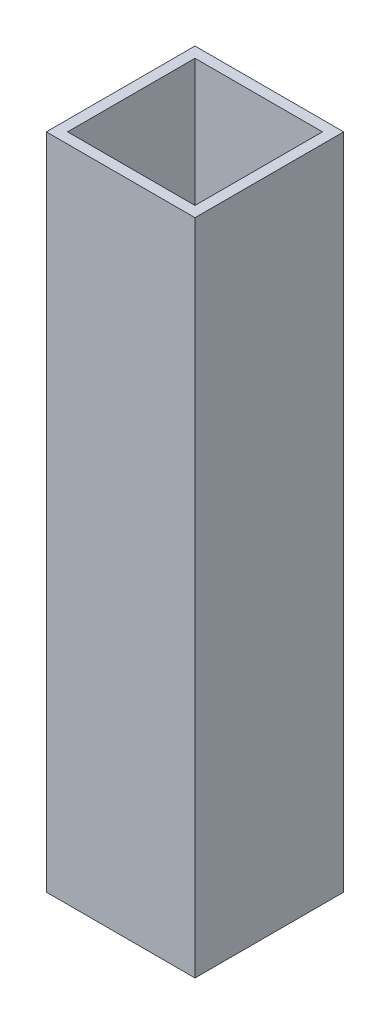
ISO-10303-21;
HEADER;
FILE_DESCRIPTION(('STEP AP214'),'2;1');
FILE_NAME('part.step','',(''),(''),'','','');
FILE_SCHEMA(('AUTOMOTIVE_DESIGN { 1 0 10303 214 1 1 1 1 }'));
ENDSEC;
DATA;
#1=APPLICATION_CONTEXT('core data for automotive mechanical design processes');
#2=APPLICATION_PROTOCOL_DEFINITION('international standard','automotive_design',2000,#1);
#3=PRODUCT_CONTEXT('',#1,'mechanical');
#4=PRODUCT('Part','Part','',(#3));
#5=PRODUCT_RELATED_PRODUCT_CATEGORY('part','',(#4));
#6=PRODUCT_DEFINITION_FORMATION('','',#4);
#7=PRODUCT_DEFINITION_CONTEXT('part definition',#1,'design');
#8=PRODUCT_DEFINITION('design','',#6,#7);
#9=PRODUCT_DEFINITION_SHAPE('','',#8);
#10=(LENGTH_UNIT() NAMED_UNIT(*) SI_UNIT(.MILLI.,.METRE.));
#11=(NAMED_UNIT(*) PLANE_ANGLE_UNIT() SI_UNIT($,.RADIAN.));
#12=(NAMED_UNIT(*) SI_UNIT($,.STERADIAN.) SOLID_ANGLE_UNIT());
#13=UNCERTAINTY_MEASURE_WITH_UNIT(LENGTH_MEASURE(1.E-05),#10,'distance_accuracy_value','');
#14=(GEOMETRIC_REPRESENTATION_CONTEXT(3) GLOBAL_UNCERTAINTY_ASSIGNED_CONTEXT((#13)) GLOBAL_UNIT_ASSIGNED_CONTEXT((#10,
#11,#12)) REPRESENTATION_CONTEXT('',''));
#15=CARTESIAN_POINT('',(0.,0.,0.));
#16=DIRECTION('',(0.,0.,1.));
#17=DIRECTION('',(1.,0.,0.));
#18=AXIS2_PLACEMENT_3D('',#15,#16,#17);
#19=CARTESIAN_POINT('',(0.,196.85,0.));
#20=DIRECTION('',(0.,-1.,0.));
#21=DIRECTION('',(0.,0.,1.));
#22=AXIS2_PLACEMENT_3D('',#19,#20,#21);
#23=PLANE('',#22);
#24=DIRECTION('',(0.,0.,-1.));
#25=VECTOR('',#24,1.);
#26=CARTESIAN_POINT('',(0.,196.85,0.));
#27=LINE('',#26,#25);
#28=CARTESIAN_POINT('',(0.,196.85,44.45));
#29=VERTEX_POINT('',#28);
#30=CARTESIAN_POINT('',(0.,196.85,0.));
#31=VERTEX_POINT('',#30);
#32=EDGE_CURVE('E138',#29,#31,#27,.T.);
#33=ORIENTED_EDGE('',*,*,#32,.F.);
#34=DIRECTION('',(-1.,0.,0.));
#35=VECTOR('',#34,1.);
#36=CARTESIAN_POINT('',(0.,196.85,44.45));
#37=LINE('',#36,#35);
#38=CARTESIAN_POINT('',(44.45,196.85,44.45));
#39=VERTEX_POINT('',#38);
#40=EDGE_CURVE('E148',#39,#29,#37,.T.);
#41=ORIENTED_EDGE('',*,*,#40,.F.);
#42=DIRECTION('',(0.,0.,1.));
#43=VECTOR('',#42,1.);
#44=CARTESIAN_POINT('',(44.45,196.85,0.));
#45=LINE('',#44,#43);
#46=CARTESIAN_POINT('',(44.45,196.85,0.));
#47=VERTEX_POINT('',#46);
#48=EDGE_CURVE('E145',#47,#39,#45,.T.);
#49=ORIENTED_EDGE('',*,*,#48,.F.);
#50=DIRECTION('',(1.,0.,0.));
#51=VECTOR('',#50,1.);
#52=CARTESIAN_POINT('',(0.,196.85,0.));
#53=LINE('',#52,#51);
#54=EDGE_CURVE('E141',#31,#47,#53,.T.);
#55=ORIENTED_EDGE('',*,*,#54,.F.);
#56=EDGE_LOOP('',(#33,#41,#49,#55));
#57=FACE_BOUND('',#56,.T.);
#58=DIRECTION('',(1.,0.,0.));
#59=VECTOR('',#58,1.);
#60=CARTESIAN_POINT('',(3.175,196.85,3.175));
#61=LINE('',#60,#59);
#62=CARTESIAN_POINT('',(3.175,196.85,3.175));
#63=VERTEX_POINT('',#62);
#64=CARTESIAN_POINT('',(41.275,196.85,3.175));
#65=VERTEX_POINT('',#64);
#66=EDGE_CURVE('E106',#63,#65,#61,.T.);
#67=ORIENTED_EDGE('',*,*,#66,.T.);
#68=DIRECTION('',(0.,0.,1.));
#69=VECTOR('',#68,1.);
#70=CARTESIAN_POINT('',(41.275,196.85,3.175));
#71=LINE('',#70,#69);
#72=CARTESIAN_POINT('',(41.275,196.85,41.275));
#73=VERTEX_POINT('',#72);
#74=EDGE_CURVE('E115',#65,#73,#71,.T.);
#75=ORIENTED_EDGE('',*,*,#74,.T.);
#76=DIRECTION('',(-1.,0.,0.));
#77=VECTOR('',#76,1.);
#78=CARTESIAN_POINT('',(3.175,196.85,41.275));
#79=LINE('',#78,#77);
#80=CARTESIAN_POINT('',(3.175,196.85,41.275));
#81=VERTEX_POINT('',#80);
#82=EDGE_CURVE('E119',#73,#81,#79,.T.);
#83=ORIENTED_EDGE('',*,*,#82,.T.);
#84=DIRECTION('',(0.,0.,-1.));
#85=VECTOR('',#84,1.);
#86=CARTESIAN_POINT('',(3.175,196.85,3.175));
#87=LINE('',#86,#85);
#88=EDGE_CURVE('E122',#81,#63,#87,.T.);
#89=ORIENTED_EDGE('',*,*,#88,.T.);
#90=EDGE_LOOP('',(#67,#75,#83,#89));
#91=FACE_BOUND('',#90,.T.);
#92=ADVANCED_FACE('F39',(#57,#91),#23,.F.);
#93=CARTESIAN_POINT('',(0.,0.,0.));
#94=DIRECTION('',(0.,-1.,0.));
#95=DIRECTION('',(0.,0.,1.));
#96=AXIS2_PLACEMENT_3D('',#93,#94,#95);
#97=PLANE('',#96);
#98=DIRECTION('',(0.,0.,-1.));
#99=VECTOR('',#98,1.);
#100=CARTESIAN_POINT('',(0.,0.,0.));
#101=LINE('',#100,#99);
#102=CARTESIAN_POINT('',(0.,0.,44.45));
#103=VERTEX_POINT('',#102);
#104=CARTESIAN_POINT('',(0.,0.,0.));
#105=VERTEX_POINT('',#104);
#106=EDGE_CURVE('E111',#103,#105,#101,.T.);
#107=ORIENTED_EDGE('',*,*,#106,.T.);
#108=DIRECTION('',(1.,0.,0.));
#109=VECTOR('',#108,1.);
#110=CARTESIAN_POINT('',(0.,0.,0.));
#111=LINE('',#110,#109);
#112=CARTESIAN_POINT('',(44.45,0.,0.));
#113=VERTEX_POINT('',#112);
#114=EDGE_CURVE('E154',#105,#113,#111,.T.);
#115=ORIENTED_EDGE('',*,*,#114,.T.);
#116=DIRECTION('',(0.,0.,1.));
#117=VECTOR('',#116,1.);
#118=CARTESIAN_POINT('',(44.45,0.,0.));
#119=LINE('',#118,#117);
#120=CARTESIAN_POINT('',(44.45,0.,44.45));
#121=VERTEX_POINT('',#120);
#122=EDGE_CURVE('E157',#113,#121,#119,.T.);
#123=ORIENTED_EDGE('',*,*,#122,.T.);
#124=DIRECTION('',(-1.,0.,0.));
#125=VECTOR('',#124,1.);
#126=CARTESIAN_POINT('',(0.,0.,44.45));
#127=LINE('',#126,#125);
#128=EDGE_CURVE('E142',#121,#103,#127,.T.);
#129=ORIENTED_EDGE('',*,*,#128,.T.);
#130=EDGE_LOOP('',(#107,#115,#123,#129));
#131=FACE_BOUND('',#130,.T.);
#132=DIRECTION('',(0.,0.,-1.));
#133=VECTOR('',#132,1.);
#134=CARTESIAN_POINT('',(3.175,0.,3.175));
#135=LINE('',#134,#133);
#136=CARTESIAN_POINT('',(3.175,0.,41.275));
#137=VERTEX_POINT('',#136);
#138=CARTESIAN_POINT('',(3.175,0.,3.175));
#139=VERTEX_POINT('',#138);
#140=EDGE_CURVE('E123',#137,#139,#135,.T.);
#141=ORIENTED_EDGE('',*,*,#140,.F.);
#142=DIRECTION('',(-1.,0.,0.));
#143=VECTOR('',#142,1.);
#144=CARTESIAN_POINT('',(3.175,0.,41.275));
#145=LINE('',#144,#143);
#146=CARTESIAN_POINT('',(41.275,0.,41.275));
#147=VERTEX_POINT('',#146);
#148=EDGE_CURVE('E126',#147,#137,#145,.T.);
#149=ORIENTED_EDGE('',*,*,#148,.F.);
#150=DIRECTION('',(0.,0.,1.));
#151=VECTOR('',#150,1.);
#152=CARTESIAN_POINT('',(41.275,0.,3.175));
#153=LINE('',#152,#151);
#154=CARTESIAN_POINT('',(41.275,0.,3.175));
#155=VERTEX_POINT('',#154);
#156=EDGE_CURVE('E132',#155,#147,#153,.T.);
#157=ORIENTED_EDGE('',*,*,#156,.F.);
#158=DIRECTION('',(1.,0.,0.));
#159=VECTOR('',#158,1.);
#160=CARTESIAN_POINT('',(3.175,0.,3.175));
#161=LINE('',#160,#159);
#162=EDGE_CURVE('E107',#139,#155,#161,.T.);
#163=ORIENTED_EDGE('',*,*,#162,.F.);
#164=EDGE_LOOP('',(#141,#149,#157,#163));
#165=FACE_BOUND('',#164,.T.);
#166=ADVANCED_FACE('F174',(#131,#165),#97,.T.);
#167=CARTESIAN_POINT('',(0.,196.85,0.));
#168=DIRECTION('',(1.,0.,0.));
#169=DIRECTION('',(0.,0.,1.));
#170=AXIS2_PLACEMENT_3D('',#167,#168,#169);
#171=PLANE('',#170);
#172=ORIENTED_EDGE('',*,*,#106,.F.);
#173=DIRECTION('',(0.,-1.,0.));
#174=VECTOR('',#173,1.);
#175=CARTESIAN_POINT('',(0.,196.85,44.45));
#176=LINE('',#175,#174);
#177=EDGE_CURVE('E151',#29,#103,#176,.T.);
#178=ORIENTED_EDGE('',*,*,#177,.F.);
#179=ORIENTED_EDGE('',*,*,#32,.T.);
#180=DIRECTION('',(0.,-1.,0.));
#181=VECTOR('',#180,1.);
#182=CARTESIAN_POINT('',(0.,196.85,0.));
#183=LINE('',#182,#181);
#184=EDGE_CURVE('E11',#31,#105,#183,.T.);
#185=ORIENTED_EDGE('',*,*,#184,.T.);
#186=EDGE_LOOP('',(#172,#178,#179,#185));
#187=FACE_BOUND('',#186,.T.);
#188=ADVANCED_FACE('F41',(#187),#171,.F.);
#189=CARTESIAN_POINT('',(0.,196.85,0.));
#190=DIRECTION('',(0.,0.,1.));
#191=DIRECTION('',(-1.,0.,0.));
#192=AXIS2_PLACEMENT_3D('',#189,#190,#191);
#193=PLANE('',#192);
#194=ORIENTED_EDGE('',*,*,#114,.F.);
#195=ORIENTED_EDGE('',*,*,#184,.F.);
#196=ORIENTED_EDGE('',*,*,#54,.T.);
#197=DIRECTION('',(0.,-1.,0.));
#198=VECTOR('',#197,1.);
#199=CARTESIAN_POINT('',(44.45,196.85,0.));
#200=LINE('',#199,#198);
#201=EDGE_CURVE('E47',#47,#113,#200,.T.);
#202=ORIENTED_EDGE('',*,*,#201,.T.);
#203=EDGE_LOOP('',(#194,#195,#196,#202));
#204=FACE_BOUND('',#203,.T.);
#205=ADVANCED_FACE('F167',(#204),#193,.F.);
#206=CARTESIAN_POINT('',(44.45,196.85,0.));
#207=DIRECTION('',(-1.,0.,0.));
#208=DIRECTION('',(0.,0.,-1.));
#209=AXIS2_PLACEMENT_3D('',#206,#207,#208);
#210=PLANE('',#209);
#211=ORIENTED_EDGE('',*,*,#122,.F.);
#212=ORIENTED_EDGE('',*,*,#201,.F.);
#213=ORIENTED_EDGE('',*,*,#48,.T.);
#214=DIRECTION('',(0.,-1.,0.));
#215=VECTOR('',#214,1.);
#216=CARTESIAN_POINT('',(44.45,196.85,44.45));
#217=LINE('',#216,#215);
#218=EDGE_CURVE('E163',#39,#121,#217,.T.);
#219=ORIENTED_EDGE('',*,*,#218,.T.);
#220=EDGE_LOOP('',(#211,#212,#213,#219));
#221=FACE_BOUND('',#220,.T.);
#222=ADVANCED_FACE('F171',(#221),#210,.F.);
#223=CARTESIAN_POINT('',(0.,196.85,44.45));
#224=DIRECTION('',(0.,0.,-1.));
#225=DIRECTION('',(1.,0.,0.));
#226=AXIS2_PLACEMENT_3D('',#223,#224,#225);
#227=PLANE('',#226);
#228=ORIENTED_EDGE('',*,*,#128,.F.);
#229=ORIENTED_EDGE('',*,*,#218,.F.);
#230=ORIENTED_EDGE('',*,*,#40,.T.);
#231=ORIENTED_EDGE('',*,*,#177,.T.);
#232=EDGE_LOOP('',(#228,#229,#230,#231));
#233=FACE_BOUND('',#232,.T.);
#234=ADVANCED_FACE('F182',(#233),#227,.F.);
#235=CARTESIAN_POINT('',(3.175,196.85,3.175));
#236=DIRECTION('',(0.,0.,1.));
#237=DIRECTION('',(-1.,0.,0.));
#238=AXIS2_PLACEMENT_3D('',#235,#236,#237);
#239=PLANE('',#238);
#240=ORIENTED_EDGE('',*,*,#162,.T.);
#241=DIRECTION('',(0.,-1.,0.));
#242=VECTOR('',#241,1.);
#243=CARTESIAN_POINT('',(41.275,196.85,3.175));
#244=LINE('',#243,#242);
#245=EDGE_CURVE('E102',#65,#155,#244,.T.);
#246=ORIENTED_EDGE('',*,*,#245,.F.);
#247=ORIENTED_EDGE('',*,*,#66,.F.);
#248=DIRECTION('',(0.,-1.,0.));
#249=VECTOR('',#248,1.);
#250=CARTESIAN_POINT('',(3.175,196.85,3.175));
#251=LINE('',#250,#249);
#252=EDGE_CURVE('E62',#63,#139,#251,.T.);
#253=ORIENTED_EDGE('',*,*,#252,.T.);
#254=EDGE_LOOP('',(#240,#246,#247,#253));
#255=FACE_BOUND('',#254,.T.);
#256=ADVANCED_FACE('F104',(#255),#239,.T.);
#257=CARTESIAN_POINT('',(41.275,196.85,3.175));
#258=DIRECTION('',(-1.,0.,0.));
#259=DIRECTION('',(0.,0.,-1.));
#260=AXIS2_PLACEMENT_3D('',#257,#258,#259);
#261=PLANE('',#260);
#262=ORIENTED_EDGE('',*,*,#156,.T.);
#263=DIRECTION('',(0.,-1.,0.));
#264=VECTOR('',#263,1.);
#265=CARTESIAN_POINT('',(41.275,196.85,41.275));
#266=LINE('',#265,#264);
#267=EDGE_CURVE('E112',#73,#147,#266,.T.);
#268=ORIENTED_EDGE('',*,*,#267,.F.);
#269=ORIENTED_EDGE('',*,*,#74,.F.);
#270=ORIENTED_EDGE('',*,*,#245,.T.);
#271=EDGE_LOOP('',(#262,#268,#269,#270));
#272=FACE_BOUND('',#271,.T.);
#273=ADVANCED_FACE('F116',(#272),#261,.T.);
#274=CARTESIAN_POINT('',(3.175,196.85,41.275));
#275=DIRECTION('',(0.,0.,-1.));
#276=DIRECTION('',(1.,0.,0.));
#277=AXIS2_PLACEMENT_3D('',#274,#275,#276);
#278=PLANE('',#277);
#279=ORIENTED_EDGE('',*,*,#148,.T.);
#280=DIRECTION('',(0.,-1.,0.));
#281=VECTOR('',#280,1.);
#282=CARTESIAN_POINT('',(3.175,196.85,41.275));
#283=LINE('',#282,#281);
#284=EDGE_CURVE('E54',#81,#137,#283,.T.);
#285=ORIENTED_EDGE('',*,*,#284,.F.);
#286=ORIENTED_EDGE('',*,*,#82,.F.);
#287=ORIENTED_EDGE('',*,*,#267,.T.);
#288=EDGE_LOOP('',(#279,#285,#286,#287));
#289=FACE_BOUND('',#288,.T.);
#290=ADVANCED_FACE('F200',(#289),#278,.T.);
#291=CARTESIAN_POINT('',(3.175,196.85,3.175));
#292=DIRECTION('',(1.,0.,0.));
#293=DIRECTION('',(0.,0.,1.));
#294=AXIS2_PLACEMENT_3D('',#291,#292,#293);
#295=PLANE('',#294);
#296=ORIENTED_EDGE('',*,*,#140,.T.);
#297=ORIENTED_EDGE('',*,*,#252,.F.);
#298=ORIENTED_EDGE('',*,*,#88,.F.);
#299=ORIENTED_EDGE('',*,*,#284,.T.);
#300=EDGE_LOOP('',(#296,#297,#298,#299));
#301=FACE_BOUND('',#300,.T.);
#302=ADVANCED_FACE('F203',(#301),#295,.T.);
#303=CLOSED_SHELL('',(#92,#166,#188,#205,#222,#234,#256,#273,#290,#302));
#304=MANIFOLD_SOLID_BREP('B2',#303);
#305=ADVANCED_BREP_SHAPE_REPRESENTATION('',(#18,#304),#14);
#306=SHAPE_DEFINITION_REPRESENTATION(#9,#305);
ENDSEC;
END-ISO-10303-21;
